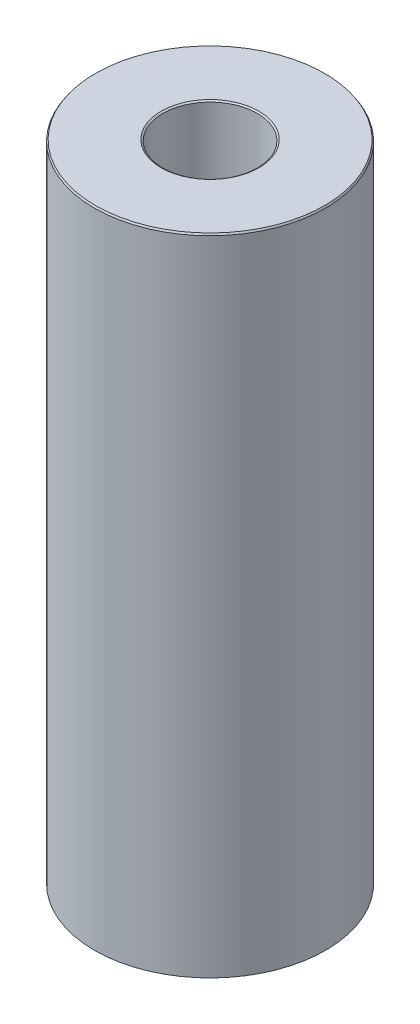
ISO-10303-21;
HEADER;
FILE_DESCRIPTION(('STEP AP214'),'2;1');
FILE_NAME('part.step','',(''),(''),'','','');
FILE_SCHEMA(('AUTOMOTIVE_DESIGN { 1 0 10303 214 1 1 1 1 }'));
ENDSEC;
DATA;
#1=APPLICATION_CONTEXT('core data for automotive mechanical design processes');
#2=APPLICATION_PROTOCOL_DEFINITION('international standard','automotive_design',2000,#1);
#3=PRODUCT_CONTEXT('',#1,'mechanical');
#4=PRODUCT('Part','Part','',(#3));
#5=PRODUCT_RELATED_PRODUCT_CATEGORY('part','',(#4));
#6=PRODUCT_DEFINITION_FORMATION('','',#4);
#7=PRODUCT_DEFINITION_CONTEXT('part definition',#1,'design');
#8=PRODUCT_DEFINITION('design','',#6,#7);
#9=PRODUCT_DEFINITION_SHAPE('','',#8);
#10=(LENGTH_UNIT() NAMED_UNIT(*) SI_UNIT(.MILLI.,.METRE.));
#11=(NAMED_UNIT(*) PLANE_ANGLE_UNIT() SI_UNIT($,.RADIAN.));
#12=(NAMED_UNIT(*) SI_UNIT($,.STERADIAN.) SOLID_ANGLE_UNIT());
#13=UNCERTAINTY_MEASURE_WITH_UNIT(LENGTH_MEASURE(1.E-05),#10,'distance_accuracy_value','');
#14=(GEOMETRIC_REPRESENTATION_CONTEXT(3) GLOBAL_UNCERTAINTY_ASSIGNED_CONTEXT((#13)) GLOBAL_UNIT_ASSIGNED_CONTEXT((#10,
#11,#12)) REPRESENTATION_CONTEXT('',''));
#15=CARTESIAN_POINT('',(0.,0.,0.));
#16=DIRECTION('',(0.,0.,1.));
#17=DIRECTION('',(1.,0.,0.));
#18=AXIS2_PLACEMENT_3D('',#15,#16,#17);
#19=CARTESIAN_POINT('',(0.,97.6892875592075,0.));
#20=DIRECTION('',(0.,-1.,0.));
#21=DIRECTION('',(0.,0.,-1.));
#22=AXIS2_PLACEMENT_3D('',#19,#20,#21);
#23=CYLINDRICAL_SURFACE('',#22,17.5);
#24=CARTESIAN_POINT('',(0.,0.163870975959726,0.));
#25=DIRECTION('',(0.,1.,0.));
#26=DIRECTION('',(0.,0.,1.));
#27=AXIS2_PLACEMENT_3D('',#24,#25,#26);
#28=CIRCLE('',#27,17.5);
#29=CARTESIAN_POINT('',(0.,0.163870975959726,17.5));
#30=VERTEX_POINT('',#29);
#31=EDGE_CURVE('E10',#30,#30,#28,.T.);
#32=ORIENTED_EDGE('',*,*,#31,.T.);
#33=EDGE_LOOP('',(#32));
#34=FACE_BOUND('',#33,.T.);
#35=CARTESIAN_POINT('',(0.,97.4445849697287,0.));
#36=DIRECTION('',(0.,1.,0.));
#37=DIRECTION('',(0.,0.,1.));
#38=AXIS2_PLACEMENT_3D('',#35,#36,#37);
#39=CIRCLE('',#38,17.5);
#40=CARTESIAN_POINT('',(0.,97.4445849697287,17.5));
#41=VERTEX_POINT('',#40);
#42=EDGE_CURVE('E50',#41,#41,#39,.F.);
#43=ORIENTED_EDGE('',*,*,#42,.T.);
#44=EDGE_LOOP('',(#43));
#45=FACE_BOUND('',#44,.T.);
#46=ADVANCED_FACE('F39',(#34,#45),#23,.T.);
#47=CARTESIAN_POINT('',(0.,97.6892875592075,0.));
#48=DIRECTION('',(0.,1.,0.));
#49=DIRECTION('',(0.,0.,1.));
#50=AXIS2_PLACEMENT_3D('',#47,#48,#49);
#51=PLANE('',#50);
#52=CARTESIAN_POINT('',(0.,97.6892875592075,0.));
#53=DIRECTION('',(0.,1.,0.));
#54=DIRECTION('',(0.,0.,1.));
#55=AXIS2_PLACEMENT_3D('',#52,#53,#54);
#56=CIRCLE('',#55,7.40667784416089);
#57=CARTESIAN_POINT('',(0.,97.6892875592075,7.40667784416089));
#58=VERTEX_POINT('',#57);
#59=EDGE_CURVE('E58',#58,#58,#56,.F.);
#60=ORIENTED_EDGE('',*,*,#59,.T.);
#61=EDGE_LOOP('',(#60));
#62=FACE_BOUND('',#61,.T.);
#63=CARTESIAN_POINT('',(0.,97.6892875592075,0.));
#64=DIRECTION('',(0.,1.,0.));
#65=DIRECTION('',(0.,0.,1.));
#66=AXIS2_PLACEMENT_3D('',#63,#64,#65);
#67=CIRCLE('',#66,17.3361290240403);
#68=CARTESIAN_POINT('',(0.,97.6892875592075,17.3361290240403));
#69=VERTEX_POINT('',#68);
#70=EDGE_CURVE('E61',#69,#69,#67,.T.);
#71=ORIENTED_EDGE('',*,*,#70,.T.);
#72=EDGE_LOOP('',(#71));
#73=FACE_BOUND('',#72,.T.);
#74=ADVANCED_FACE('F88',(#62,#73),#51,.T.);
#75=CARTESIAN_POINT('',(0.,0.,0.));
#76=DIRECTION('',(0.,1.,0.));
#77=DIRECTION('',(0.,0.,1.));
#78=AXIS2_PLACEMENT_3D('',#75,#76,#77);
#79=PLANE('',#78);
#80=CARTESIAN_POINT('',(0.,0.,0.));
#81=DIRECTION('',(0.,1.,0.));
#82=DIRECTION('',(0.,0.,1.));
#83=AXIS2_PLACEMENT_3D('',#80,#81,#82);
#84=CIRCLE('',#83,7.32584623064179);
#85=CARTESIAN_POINT('',(0.,0.,7.32584623064179));
#86=VERTEX_POINT('',#85);
#87=EDGE_CURVE('E51',#86,#86,#84,.T.);
#88=ORIENTED_EDGE('',*,*,#87,.T.);
#89=EDGE_LOOP('',(#88));
#90=FACE_BOUND('',#89,.T.);
#91=CARTESIAN_POINT('',(0.,0.,0.));
#92=DIRECTION('',(0.,1.,0.));
#93=DIRECTION('',(0.,0.,1.));
#94=AXIS2_PLACEMENT_3D('',#91,#92,#93);
#95=CIRCLE('',#94,17.2552974105212);
#96=CARTESIAN_POINT('',(0.,0.,17.2552974105212));
#97=VERTEX_POINT('',#96);
#98=EDGE_CURVE('E54',#97,#97,#95,.F.);
#99=ORIENTED_EDGE('',*,*,#98,.T.);
#100=EDGE_LOOP('',(#99));
#101=FACE_BOUND('',#100,.T.);
#102=ADVANCED_FACE('F83',(#90,#101),#79,.F.);
#103=CARTESIAN_POINT('',(0.,97.6892875592075,0.));
#104=DIRECTION('',(0.,-1.,0.));
#105=DIRECTION('',(0.,0.,-1.));
#106=AXIS2_PLACEMENT_3D('',#103,#104,#105);
#107=CYLINDRICAL_SURFACE('',#106,7.16197525468207);
#108=CARTESIAN_POINT('',(0.,97.5254165832478,0.));
#109=DIRECTION('',(0.,1.,0.));
#110=DIRECTION('',(0.,0.,1.));
#111=AXIS2_PLACEMENT_3D('',#108,#109,#110);
#112=CIRCLE('',#111,7.16197525468207);
#113=CARTESIAN_POINT('',(0.,97.5254165832478,7.16197525468207));
#114=VERTEX_POINT('',#113);
#115=EDGE_CURVE('E67',#114,#114,#112,.T.);
#116=ORIENTED_EDGE('',*,*,#115,.T.);
#117=EDGE_LOOP('',(#116));
#118=FACE_BOUND('',#117,.T.);
#119=CARTESIAN_POINT('',(0.,0.244702589478799,0.));
#120=DIRECTION('',(0.,1.,0.));
#121=DIRECTION('',(0.,0.,1.));
#122=AXIS2_PLACEMENT_3D('',#119,#120,#121);
#123=CIRCLE('',#122,7.16197525468207);
#124=CARTESIAN_POINT('',(0.,0.244702589478799,7.16197525468207));
#125=VERTEX_POINT('',#124);
#126=EDGE_CURVE('E69',#125,#125,#123,.F.);
#127=ORIENTED_EDGE('',*,*,#126,.T.);
#128=EDGE_LOOP('',(#127));
#129=FACE_BOUND('',#128,.T.);
#130=ADVANCED_FACE('F71',(#118,#129),#107,.F.);
#131=CARTESIAN_POINT('',(0.,97.5254165832478,0.));
#132=DIRECTION('',(0.,1.,0.));
#133=DIRECTION('',(0.,0.,1.));
#134=AXIS2_PLACEMENT_3D('',#131,#132,#133);
#135=CONICAL_SURFACE('',#134,7.16197525468207,0.980714572405151);
#136=ORIENTED_EDGE('',*,*,#59,.F.);
#137=EDGE_LOOP('',(#136));
#138=FACE_BOUND('',#137,.T.);
#139=ORIENTED_EDGE('',*,*,#115,.F.);
#140=EDGE_LOOP('',(#139));
#141=FACE_BOUND('',#140,.T.);
#142=ADVANCED_FACE('F77',(#138,#141),#135,.F.);
#143=CARTESIAN_POINT('',(0.,0.,0.));
#144=DIRECTION('',(0.,-1.,0.));
#145=DIRECTION('',(0.,0.,-1.));
#146=AXIS2_PLACEMENT_3D('',#143,#144,#145);
#147=CONICAL_SURFACE('',#146,7.32584623064179,0.590081754389707);
#148=ORIENTED_EDGE('',*,*,#126,.F.);
#149=EDGE_LOOP('',(#148));
#150=FACE_BOUND('',#149,.T.);
#151=ORIENTED_EDGE('',*,*,#87,.F.);
#152=EDGE_LOOP('',(#151));
#153=FACE_BOUND('',#152,.T.);
#154=ADVANCED_FACE('F73',(#150,#153),#147,.F.);
#155=CARTESIAN_POINT('',(0.,0.163870975959726,0.));
#156=DIRECTION('',(0.,1.,0.));
#157=DIRECTION('',(0.,0.,1.));
#158=AXIS2_PLACEMENT_3D('',#155,#156,#157);
#159=CONICAL_SURFACE('',#158,17.5,0.980714572405189);
#160=ORIENTED_EDGE('',*,*,#98,.F.);
#161=EDGE_LOOP('',(#160));
#162=FACE_BOUND('',#161,.T.);
#163=ORIENTED_EDGE('',*,*,#31,.F.);
#164=EDGE_LOOP('',(#163));
#165=FACE_BOUND('',#164,.T.);
#166=ADVANCED_FACE('F76',(#162,#165),#159,.T.);
#167=CARTESIAN_POINT('',(0.,97.6892875592075,0.));
#168=DIRECTION('',(0.,-1.,0.));
#169=DIRECTION('',(0.,0.,-1.));
#170=AXIS2_PLACEMENT_3D('',#167,#168,#169);
#171=CONICAL_SURFACE('',#170,17.3361290240403,0.590081754389727);
#172=ORIENTED_EDGE('',*,*,#42,.F.);
#173=EDGE_LOOP('',(#172));
#174=FACE_BOUND('',#173,.T.);
#175=ORIENTED_EDGE('',*,*,#70,.F.);
#176=EDGE_LOOP('',(#175));
#177=FACE_BOUND('',#176,.T.);
#178=ADVANCED_FACE('F45',(#174,#177),#171,.T.);
#179=CLOSED_SHELL('',(#46,#74,#102,#130,#142,#154,#166,#178));
#180=MANIFOLD_SOLID_BREP('B2',#179);
#181=ADVANCED_BREP_SHAPE_REPRESENTATION('',(#18,#180),#14);
#182=SHAPE_DEFINITION_REPRESENTATION(#9,#181);
ENDSEC;
END-ISO-10303-21;
